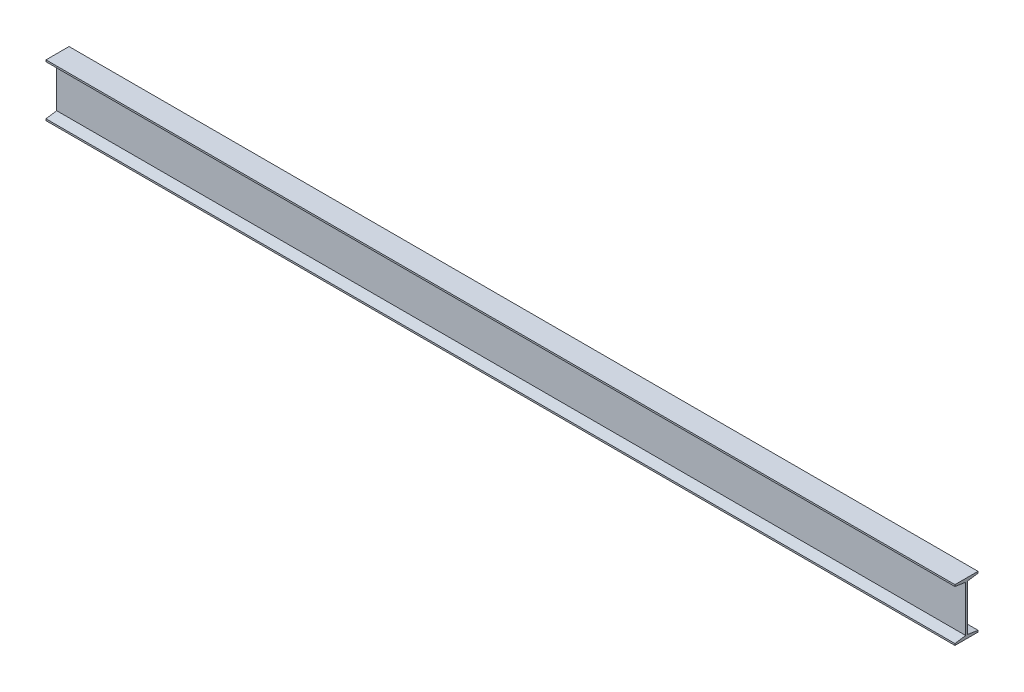
ISO-10303-21;
HEADER;
FILE_DESCRIPTION(('STEP AP214'),'2;1');
FILE_NAME('part.step','',(''),(''),'','','');
FILE_SCHEMA(('AUTOMOTIVE_DESIGN { 1 0 10303 214 1 1 1 1 }'));
ENDSEC;
DATA;
#1=APPLICATION_CONTEXT('core data for automotive mechanical design processes');
#2=APPLICATION_PROTOCOL_DEFINITION('international standard','automotive_design',2000,#1);
#3=PRODUCT_CONTEXT('',#1,'mechanical');
#4=PRODUCT('Part','Part','',(#3));
#5=PRODUCT_RELATED_PRODUCT_CATEGORY('part','',(#4));
#6=PRODUCT_DEFINITION_FORMATION('','',#4);
#7=PRODUCT_DEFINITION_CONTEXT('part definition',#1,'design');
#8=PRODUCT_DEFINITION('design','',#6,#7);
#9=PRODUCT_DEFINITION_SHAPE('','',#8);
#10=(LENGTH_UNIT() NAMED_UNIT(*) SI_UNIT(.MILLI.,.METRE.));
#11=(NAMED_UNIT(*) PLANE_ANGLE_UNIT() SI_UNIT($,.RADIAN.));
#12=(NAMED_UNIT(*) SI_UNIT($,.STERADIAN.) SOLID_ANGLE_UNIT());
#13=UNCERTAINTY_MEASURE_WITH_UNIT(LENGTH_MEASURE(1.E-05),#10,'distance_accuracy_value','');
#14=(GEOMETRIC_REPRESENTATION_CONTEXT(3) GLOBAL_UNCERTAINTY_ASSIGNED_CONTEXT((#13)) GLOBAL_UNIT_ASSIGNED_CONTEXT((#10,
#11,#12)) REPRESENTATION_CONTEXT('',''));
#15=CARTESIAN_POINT('',(0.,0.,0.));
#16=DIRECTION('',(0.,0.,1.));
#17=DIRECTION('',(1.,0.,0.));
#18=AXIS2_PLACEMENT_3D('',#15,#16,#17);
#19=CARTESIAN_POINT('',(3505.2,203.2,0.));
#20=DIRECTION('',(0.,0.,-1.));
#21=DIRECTION('',(0.,1.,0.));
#22=AXIS2_PLACEMENT_3D('',#19,#20,#21);
#23=PLANE('',#22);
#24=DIRECTION('',(0.,-1.,0.));
#25=VECTOR('',#24,1.);
#26=CARTESIAN_POINT('',(0.,203.2,0.));
#27=LINE('',#26,#25);
#28=CARTESIAN_POINT('',(0.,203.2,0.));
#29=VERTEX_POINT('',#28);
#30=CARTESIAN_POINT('',(0.,196.85,0.));
#31=VERTEX_POINT('',#30);
#32=EDGE_CURVE('E167',#29,#31,#27,.T.);
#33=ORIENTED_EDGE('',*,*,#32,.T.);
#34=DIRECTION('',(-1.,0.,0.));
#35=VECTOR('',#34,1.);
#36=CARTESIAN_POINT('',(3505.2,196.85,0.));
#37=LINE('',#36,#35);
#38=CARTESIAN_POINT('',(3505.2,196.85,0.));
#39=VERTEX_POINT('',#38);
#40=EDGE_CURVE('E11',#39,#31,#37,.T.);
#41=ORIENTED_EDGE('',*,*,#40,.F.);
#42=DIRECTION('',(0.,-1.,0.));
#43=VECTOR('',#42,1.);
#44=CARTESIAN_POINT('',(3505.2,203.2,0.));
#45=LINE('',#44,#43);
#46=CARTESIAN_POINT('',(3505.2,203.2,0.));
#47=VERTEX_POINT('',#46);
#48=EDGE_CURVE('E197',#47,#39,#45,.T.);
#49=ORIENTED_EDGE('',*,*,#48,.F.);
#50=DIRECTION('',(-1.,0.,0.));
#51=VECTOR('',#50,1.);
#52=CARTESIAN_POINT('',(3505.2,203.2,0.));
#53=LINE('',#52,#51);
#54=EDGE_CURVE('E59',#47,#29,#53,.T.);
#55=ORIENTED_EDGE('',*,*,#54,.T.);
#56=EDGE_LOOP('',(#33,#41,#49,#55));
#57=FACE_BOUND('',#56,.T.);
#58=ADVANCED_FACE('F43',(#57),#23,.F.);
#59=CARTESIAN_POINT('',(3505.2,196.85,0.));
#60=DIRECTION('',(0.,0.988371697650617,-0.15205718425394));
#61=DIRECTION('',(0.,0.15205718425394,0.988371697650617));
#62=AXIS2_PLACEMENT_3D('',#59,#60,#61);
#63=PLANE('',#62);
#64=DIRECTION('',(0.,-0.15205718425394,-0.988371697650617));
#65=VECTOR('',#64,1.);
#66=CARTESIAN_POINT('',(0.,196.85,0.));
#67=LINE('',#66,#65);
#68=CARTESIAN_POINT('',(0.,190.5,-41.275));
#69=VERTEX_POINT('',#68);
#70=EDGE_CURVE('E169',#31,#69,#67,.T.);
#71=ORIENTED_EDGE('',*,*,#70,.T.);
#72=DIRECTION('',(-1.,0.,0.));
#73=VECTOR('',#72,1.);
#74=CARTESIAN_POINT('',(3505.2,190.5,-41.275));
#75=LINE('',#74,#73);
#76=CARTESIAN_POINT('',(3505.2,190.5,-41.275));
#77=VERTEX_POINT('',#76);
#78=EDGE_CURVE('E51',#77,#69,#75,.T.);
#79=ORIENTED_EDGE('',*,*,#78,.F.);
#80=DIRECTION('',(0.,-0.15205718425394,-0.988371697650617));
#81=VECTOR('',#80,1.);
#82=CARTESIAN_POINT('',(3505.2,196.85,0.));
#83=LINE('',#82,#81);
#84=EDGE_CURVE('E109',#39,#77,#83,.T.);
#85=ORIENTED_EDGE('',*,*,#84,.F.);
#86=ORIENTED_EDGE('',*,*,#40,.T.);
#87=EDGE_LOOP('',(#71,#79,#85,#86));
#88=FACE_BOUND('',#87,.T.);
#89=ADVANCED_FACE('F226',(#88),#63,.F.);
#90=CARTESIAN_POINT('',(3505.2,12.7,-41.275));
#91=DIRECTION('',(0.,0.,1.));
#92=DIRECTION('',(1.,0.,0.));
#93=AXIS2_PLACEMENT_3D('',#90,#91,#92);
#94=PLANE('',#93);
#95=DIRECTION('',(0.,1.,0.));
#96=VECTOR('',#95,1.);
#97=CARTESIAN_POINT('',(0.,12.7,-41.275));
#98=LINE('',#97,#96);
#99=CARTESIAN_POINT('',(0.,12.7,-41.275));
#100=VERTEX_POINT('',#99);
#101=EDGE_CURVE('E172',#100,#69,#98,.T.);
#102=ORIENTED_EDGE('',*,*,#101,.F.);
#103=DIRECTION('',(-1.,0.,0.));
#104=VECTOR('',#103,1.);
#105=CARTESIAN_POINT('',(3505.2,12.7,-41.275));
#106=LINE('',#105,#104);
#107=CARTESIAN_POINT('',(3505.2,12.7,-41.275));
#108=VERTEX_POINT('',#107);
#109=EDGE_CURVE('E218',#108,#100,#106,.T.);
#110=ORIENTED_EDGE('',*,*,#109,.F.);
#111=DIRECTION('',(0.,1.,0.));
#112=VECTOR('',#111,1.);
#113=CARTESIAN_POINT('',(3505.2,12.7,-41.275));
#114=LINE('',#113,#112);
#115=EDGE_CURVE('E225',#108,#77,#114,.T.);
#116=ORIENTED_EDGE('',*,*,#115,.T.);
#117=ORIENTED_EDGE('',*,*,#78,.T.);
#118=EDGE_LOOP('',(#102,#110,#116,#117));
#119=FACE_BOUND('',#118,.T.);
#120=ADVANCED_FACE('F223',(#119),#94,.T.);
#121=CARTESIAN_POINT('',(3505.2,6.35,0.));
#122=DIRECTION('',(0.,0.988371697650617,0.152057184253941));
#123=DIRECTION('',(0.,-0.152057184253941,0.988371697650617));
#124=AXIS2_PLACEMENT_3D('',#121,#122,#123);
#125=PLANE('',#124);
#126=DIRECTION('',(0.,0.152057184253941,-0.988371697650617));
#127=VECTOR('',#126,1.);
#128=CARTESIAN_POINT('',(0.,6.35,0.));
#129=LINE('',#128,#127);
#130=CARTESIAN_POINT('',(0.,6.35,0.));
#131=VERTEX_POINT('',#130);
#132=EDGE_CURVE('E175',#131,#100,#129,.T.);
#133=ORIENTED_EDGE('',*,*,#132,.F.);
#134=DIRECTION('',(-1.,0.,0.));
#135=VECTOR('',#134,1.);
#136=CARTESIAN_POINT('',(3505.2,6.35,0.));
#137=LINE('',#136,#135);
#138=CARTESIAN_POINT('',(3505.2,6.35,0.));
#139=VERTEX_POINT('',#138);
#140=EDGE_CURVE('E215',#139,#131,#137,.T.);
#141=ORIENTED_EDGE('',*,*,#140,.F.);
#142=DIRECTION('',(0.,0.152057184253941,-0.988371697650617));
#143=VECTOR('',#142,1.);
#144=CARTESIAN_POINT('',(3505.2,6.35,0.));
#145=LINE('',#144,#143);
#146=EDGE_CURVE('E236',#139,#108,#145,.T.);
#147=ORIENTED_EDGE('',*,*,#146,.T.);
#148=ORIENTED_EDGE('',*,*,#109,.T.);
#149=EDGE_LOOP('',(#133,#141,#147,#148));
#150=FACE_BOUND('',#149,.T.);
#151=ADVANCED_FACE('F233',(#150),#125,.T.);
#152=CARTESIAN_POINT('',(3505.2,0.,0.));
#153=DIRECTION('',(0.,0.,1.));
#154=DIRECTION('',(1.,0.,0.));
#155=AXIS2_PLACEMENT_3D('',#152,#153,#154);
#156=PLANE('',#155);
#157=DIRECTION('',(0.,1.,0.));
#158=VECTOR('',#157,1.);
#159=CARTESIAN_POINT('',(0.,0.,0.));
#160=LINE('',#159,#158);
#161=CARTESIAN_POINT('',(0.,0.,0.));
#162=VERTEX_POINT('',#161);
#163=EDGE_CURVE('E178',#162,#131,#160,.T.);
#164=ORIENTED_EDGE('',*,*,#163,.F.);
#165=DIRECTION('',(-1.,0.,0.));
#166=VECTOR('',#165,1.);
#167=CARTESIAN_POINT('',(3505.2,0.,0.));
#168=LINE('',#167,#166);
#169=CARTESIAN_POINT('',(3505.2,0.,0.));
#170=VERTEX_POINT('',#169);
#171=EDGE_CURVE('E212',#170,#162,#168,.T.);
#172=ORIENTED_EDGE('',*,*,#171,.F.);
#173=DIRECTION('',(0.,1.,0.));
#174=VECTOR('',#173,1.);
#175=CARTESIAN_POINT('',(3505.2,0.,0.));
#176=LINE('',#175,#174);
#177=EDGE_CURVE('E241',#170,#139,#176,.T.);
#178=ORIENTED_EDGE('',*,*,#177,.T.);
#179=ORIENTED_EDGE('',*,*,#140,.T.);
#180=EDGE_LOOP('',(#164,#172,#178,#179));
#181=FACE_BOUND('',#180,.T.);
#182=ADVANCED_FACE('F288',(#181),#156,.T.);
#183=CARTESIAN_POINT('',(3505.2,0.,-88.9));
#184=DIRECTION('',(0.,-1.,0.));
#185=DIRECTION('',(0.,0.,-1.));
#186=AXIS2_PLACEMENT_3D('',#183,#184,#185);
#187=PLANE('',#186);
#188=DIRECTION('',(0.,0.,1.));
#189=VECTOR('',#188,1.);
#190=CARTESIAN_POINT('',(0.,0.,-88.9));
#191=LINE('',#190,#189);
#192=CARTESIAN_POINT('',(0.,0.,-88.9));
#193=VERTEX_POINT('',#192);
#194=EDGE_CURVE('E181',#193,#162,#191,.T.);
#195=ORIENTED_EDGE('',*,*,#194,.F.);
#196=DIRECTION('',(-1.,0.,0.));
#197=VECTOR('',#196,1.);
#198=CARTESIAN_POINT('',(3505.2,0.,-88.9));
#199=LINE('',#198,#197);
#200=CARTESIAN_POINT('',(3505.2,0.,-88.9));
#201=VERTEX_POINT('',#200);
#202=EDGE_CURVE('E209',#201,#193,#199,.T.);
#203=ORIENTED_EDGE('',*,*,#202,.F.);
#204=DIRECTION('',(0.,0.,1.));
#205=VECTOR('',#204,1.);
#206=CARTESIAN_POINT('',(3505.2,0.,-88.9));
#207=LINE('',#206,#205);
#208=EDGE_CURVE('E248',#201,#170,#207,.T.);
#209=ORIENTED_EDGE('',*,*,#208,.T.);
#210=ORIENTED_EDGE('',*,*,#171,.T.);
#211=EDGE_LOOP('',(#195,#203,#209,#210));
#212=FACE_BOUND('',#211,.T.);
#213=ADVANCED_FACE('F291',(#212),#187,.T.);
#214=CARTESIAN_POINT('',(3505.2,0.,-88.9));
#215=DIRECTION('',(0.,0.,1.));
#216=DIRECTION('',(1.,0.,0.));
#217=AXIS2_PLACEMENT_3D('',#214,#215,#216);
#218=PLANE('',#217);
#219=DIRECTION('',(0.,1.,0.));
#220=VECTOR('',#219,1.);
#221=CARTESIAN_POINT('',(0.,0.,-88.9));
#222=LINE('',#221,#220);
#223=CARTESIAN_POINT('',(0.,6.35,-88.9));
#224=VERTEX_POINT('',#223);
#225=EDGE_CURVE('E184',#193,#224,#222,.T.);
#226=ORIENTED_EDGE('',*,*,#225,.T.);
#227=DIRECTION('',(-1.,0.,0.));
#228=VECTOR('',#227,1.);
#229=CARTESIAN_POINT('',(3505.2,6.35,-88.9));
#230=LINE('',#229,#228);
#231=CARTESIAN_POINT('',(3505.2,6.35,-88.9));
#232=VERTEX_POINT('',#231);
#233=EDGE_CURVE('E205',#232,#224,#230,.T.);
#234=ORIENTED_EDGE('',*,*,#233,.F.);
#235=DIRECTION('',(0.,1.,0.));
#236=VECTOR('',#235,1.);
#237=CARTESIAN_POINT('',(3505.2,0.,-88.9));
#238=LINE('',#237,#236);
#239=EDGE_CURVE('E252',#201,#232,#238,.T.);
#240=ORIENTED_EDGE('',*,*,#239,.F.);
#241=ORIENTED_EDGE('',*,*,#202,.T.);
#242=EDGE_LOOP('',(#226,#234,#240,#241));
#243=FACE_BOUND('',#242,.T.);
#244=ADVANCED_FACE('F295',(#243),#218,.F.);
#245=CARTESIAN_POINT('',(3505.2,6.35,-88.9));
#246=DIRECTION('',(0.,-0.988371697650617,0.152057184253941));
#247=DIRECTION('',(0.,-0.152057184253941,-0.988371697650617));
#248=AXIS2_PLACEMENT_3D('',#245,#246,#247);
#249=PLANE('',#248);
#250=DIRECTION('',(0.,0.152057184253941,0.988371697650617));
#251=VECTOR('',#250,1.);
#252=CARTESIAN_POINT('',(0.,6.35,-88.9));
#253=LINE('',#252,#251);
#254=CARTESIAN_POINT('',(0.,12.7,-47.625));
#255=VERTEX_POINT('',#254);
#256=EDGE_CURVE('E186',#224,#255,#253,.T.);
#257=ORIENTED_EDGE('',*,*,#256,.T.);
#258=DIRECTION('',(-1.,0.,0.));
#259=VECTOR('',#258,1.);
#260=CARTESIAN_POINT('',(3505.2,12.7,-47.625));
#261=LINE('',#260,#259);
#262=CARTESIAN_POINT('',(3505.2,12.7,-47.625));
#263=VERTEX_POINT('',#262);
#264=EDGE_CURVE('E201',#263,#255,#261,.T.);
#265=ORIENTED_EDGE('',*,*,#264,.F.);
#266=DIRECTION('',(0.,0.152057184253941,0.988371697650617));
#267=VECTOR('',#266,1.);
#268=CARTESIAN_POINT('',(3505.2,6.35,-88.9));
#269=LINE('',#268,#267);
#270=EDGE_CURVE('E254',#232,#263,#269,.T.);
#271=ORIENTED_EDGE('',*,*,#270,.F.);
#272=ORIENTED_EDGE('',*,*,#233,.T.);
#273=EDGE_LOOP('',(#257,#265,#271,#272));
#274=FACE_BOUND('',#273,.T.);
#275=ADVANCED_FACE('F262',(#274),#249,.F.);
#276=CARTESIAN_POINT('',(3505.2,12.7,-47.625));
#277=DIRECTION('',(0.,0.,1.));
#278=DIRECTION('',(0.,-1.,0.));
#279=AXIS2_PLACEMENT_3D('',#276,#277,#278);
#280=PLANE('',#279);
#281=DIRECTION('',(0.,1.,0.));
#282=VECTOR('',#281,1.);
#283=CARTESIAN_POINT('',(0.,12.7,-47.625));
#284=LINE('',#283,#282);
#285=CARTESIAN_POINT('',(0.,190.5,-47.6249999999999));
#286=VERTEX_POINT('',#285);
#287=EDGE_CURVE('E188',#255,#286,#284,.T.);
#288=ORIENTED_EDGE('',*,*,#287,.T.);
#289=DIRECTION('',(-1.,0.,0.));
#290=VECTOR('',#289,1.);
#291=CARTESIAN_POINT('',(3505.2,190.5,-47.6249999999999));
#292=LINE('',#291,#290);
#293=CARTESIAN_POINT('',(3505.2,190.5,-47.6249999999999));
#294=VERTEX_POINT('',#293);
#295=EDGE_CURVE('E150',#294,#286,#292,.T.);
#296=ORIENTED_EDGE('',*,*,#295,.F.);
#297=DIRECTION('',(0.,1.,0.));
#298=VECTOR('',#297,1.);
#299=CARTESIAN_POINT('',(3505.2,12.7,-47.625));
#300=LINE('',#299,#298);
#301=EDGE_CURVE('E158',#263,#294,#300,.T.);
#302=ORIENTED_EDGE('',*,*,#301,.F.);
#303=ORIENTED_EDGE('',*,*,#264,.T.);
#304=EDGE_LOOP('',(#288,#296,#302,#303));
#305=FACE_BOUND('',#304,.T.);
#306=ADVANCED_FACE('F266',(#305),#280,.F.);
#307=CARTESIAN_POINT('',(3505.2,196.85,-88.9));
#308=DIRECTION('',(0.,-0.988371697650617,-0.15205718425394));
#309=DIRECTION('',(0.,0.15205718425394,-0.988371697650617));
#310=AXIS2_PLACEMENT_3D('',#307,#308,#309);
#311=PLANE('',#310);
#312=DIRECTION('',(0.,-0.15205718425394,0.988371697650617));
#313=VECTOR('',#312,1.);
#314=CARTESIAN_POINT('',(0.,196.85,-88.9));
#315=LINE('',#314,#313);
#316=CARTESIAN_POINT('',(0.,196.85,-88.9));
#317=VERTEX_POINT('',#316);
#318=EDGE_CURVE('E146',#317,#286,#315,.T.);
#319=ORIENTED_EDGE('',*,*,#318,.F.);
#320=DIRECTION('',(-1.,0.,0.));
#321=VECTOR('',#320,1.);
#322=CARTESIAN_POINT('',(3505.2,196.85,-88.9));
#323=LINE('',#322,#321);
#324=CARTESIAN_POINT('',(3505.2,196.85,-88.9));
#325=VERTEX_POINT('',#324);
#326=EDGE_CURVE('E141',#325,#317,#323,.T.);
#327=ORIENTED_EDGE('',*,*,#326,.F.);
#328=DIRECTION('',(0.,-0.15205718425394,0.988371697650617));
#329=VECTOR('',#328,1.);
#330=CARTESIAN_POINT('',(3505.2,196.85,-88.9));
#331=LINE('',#330,#329);
#332=EDGE_CURVE('E144',#325,#294,#331,.T.);
#333=ORIENTED_EDGE('',*,*,#332,.T.);
#334=ORIENTED_EDGE('',*,*,#295,.T.);
#335=EDGE_LOOP('',(#319,#327,#333,#334));
#336=FACE_BOUND('',#335,.T.);
#337=ADVANCED_FACE('F143',(#336),#311,.T.);
#338=CARTESIAN_POINT('',(3505.2,203.2,-88.9));
#339=DIRECTION('',(0.,0.,-1.));
#340=DIRECTION('',(-1.,0.,0.));
#341=AXIS2_PLACEMENT_3D('',#338,#339,#340);
#342=PLANE('',#341);
#343=DIRECTION('',(0.,-1.,0.));
#344=VECTOR('',#343,1.);
#345=CARTESIAN_POINT('',(0.,203.2,-88.9));
#346=LINE('',#345,#344);
#347=CARTESIAN_POINT('',(0.,203.2,-88.9));
#348=VERTEX_POINT('',#347);
#349=EDGE_CURVE('E192',#348,#317,#346,.T.);
#350=ORIENTED_EDGE('',*,*,#349,.F.);
#351=DIRECTION('',(-1.,0.,0.));
#352=VECTOR('',#351,1.);
#353=CARTESIAN_POINT('',(3505.2,203.2,-88.9));
#354=LINE('',#353,#352);
#355=CARTESIAN_POINT('',(3505.2,203.2,-88.9));
#356=VERTEX_POINT('',#355);
#357=EDGE_CURVE('E97',#356,#348,#354,.T.);
#358=ORIENTED_EDGE('',*,*,#357,.F.);
#359=DIRECTION('',(0.,-1.,0.));
#360=VECTOR('',#359,1.);
#361=CARTESIAN_POINT('',(3505.2,203.2,-88.9));
#362=LINE('',#361,#360);
#363=EDGE_CURVE('E156',#356,#325,#362,.T.);
#364=ORIENTED_EDGE('',*,*,#363,.T.);
#365=ORIENTED_EDGE('',*,*,#326,.T.);
#366=EDGE_LOOP('',(#350,#358,#364,#365));
#367=FACE_BOUND('',#366,.T.);
#368=ADVANCED_FACE('F161',(#367),#342,.T.);
#369=CARTESIAN_POINT('',(3505.2,203.2,0.));
#370=DIRECTION('',(0.,1.,0.));
#371=DIRECTION('',(0.,0.,1.));
#372=AXIS2_PLACEMENT_3D('',#369,#370,#371);
#373=PLANE('',#372);
#374=DIRECTION('',(0.,0.,-1.));
#375=VECTOR('',#374,1.);
#376=CARTESIAN_POINT('',(0.,203.2,0.));
#377=LINE('',#376,#375);
#378=EDGE_CURVE('E194',#29,#348,#377,.T.);
#379=ORIENTED_EDGE('',*,*,#378,.F.);
#380=ORIENTED_EDGE('',*,*,#54,.F.);
#381=DIRECTION('',(0.,0.,-1.));
#382=VECTOR('',#381,1.);
#383=CARTESIAN_POINT('',(3505.2,203.2,0.));
#384=LINE('',#383,#382);
#385=EDGE_CURVE('E162',#47,#356,#384,.T.);
#386=ORIENTED_EDGE('',*,*,#385,.T.);
#387=ORIENTED_EDGE('',*,*,#357,.T.);
#388=EDGE_LOOP('',(#379,#380,#386,#387));
#389=FACE_BOUND('',#388,.T.);
#390=ADVANCED_FACE('F267',(#389),#373,.T.);
#391=CARTESIAN_POINT('',(3505.2,0.,0.));
#392=DIRECTION('',(-1.,0.,0.));
#393=DIRECTION('',(0.,0.,1.));
#394=AXIS2_PLACEMENT_3D('',#391,#392,#393);
#395=PLANE('',#394);
#396=ORIENTED_EDGE('',*,*,#48,.T.);
#397=ORIENTED_EDGE('',*,*,#84,.T.);
#398=ORIENTED_EDGE('',*,*,#115,.F.);
#399=ORIENTED_EDGE('',*,*,#146,.F.);
#400=ORIENTED_EDGE('',*,*,#177,.F.);
#401=ORIENTED_EDGE('',*,*,#208,.F.);
#402=ORIENTED_EDGE('',*,*,#239,.T.);
#403=ORIENTED_EDGE('',*,*,#270,.T.);
#404=ORIENTED_EDGE('',*,*,#301,.T.);
#405=ORIENTED_EDGE('',*,*,#332,.F.);
#406=ORIENTED_EDGE('',*,*,#363,.F.);
#407=ORIENTED_EDGE('',*,*,#385,.F.);
#408=EDGE_LOOP('',(#396,#397,#398,#399,#400,#401,#402,#403,#404,#405,#406,#407));
#409=FACE_BOUND('',#408,.T.);
#410=ADVANCED_FACE('F154',(#409),#395,.F.);
#411=CARTESIAN_POINT('',(0.,0.,0.));
#412=DIRECTION('',(-1.,0.,0.));
#413=DIRECTION('',(0.,0.,1.));
#414=AXIS2_PLACEMENT_3D('',#411,#412,#413);
#415=PLANE('',#414);
#416=ORIENTED_EDGE('',*,*,#32,.F.);
#417=ORIENTED_EDGE('',*,*,#378,.T.);
#418=ORIENTED_EDGE('',*,*,#349,.T.);
#419=ORIENTED_EDGE('',*,*,#318,.T.);
#420=ORIENTED_EDGE('',*,*,#287,.F.);
#421=ORIENTED_EDGE('',*,*,#256,.F.);
#422=ORIENTED_EDGE('',*,*,#225,.F.);
#423=ORIENTED_EDGE('',*,*,#194,.T.);
#424=ORIENTED_EDGE('',*,*,#163,.T.);
#425=ORIENTED_EDGE('',*,*,#132,.T.);
#426=ORIENTED_EDGE('',*,*,#101,.T.);
#427=ORIENTED_EDGE('',*,*,#70,.F.);
#428=EDGE_LOOP('',(#416,#417,#418,#419,#420,#421,#422,#423,#424,#425,#426,#427));
#429=FACE_BOUND('',#428,.T.);
#430=ADVANCED_FACE('F229',(#429),#415,.T.);
#431=CLOSED_SHELL('',(#58,#89,#120,#151,#182,#213,#244,#275,#306,#337,#368,#390,#410,#430));
#432=MANIFOLD_SOLID_BREP('B2',#431);
#433=ADVANCED_BREP_SHAPE_REPRESENTATION('',(#18,#432),#14);
#434=SHAPE_DEFINITION_REPRESENTATION(#9,#433);
ENDSEC;
END-ISO-10303-21;
